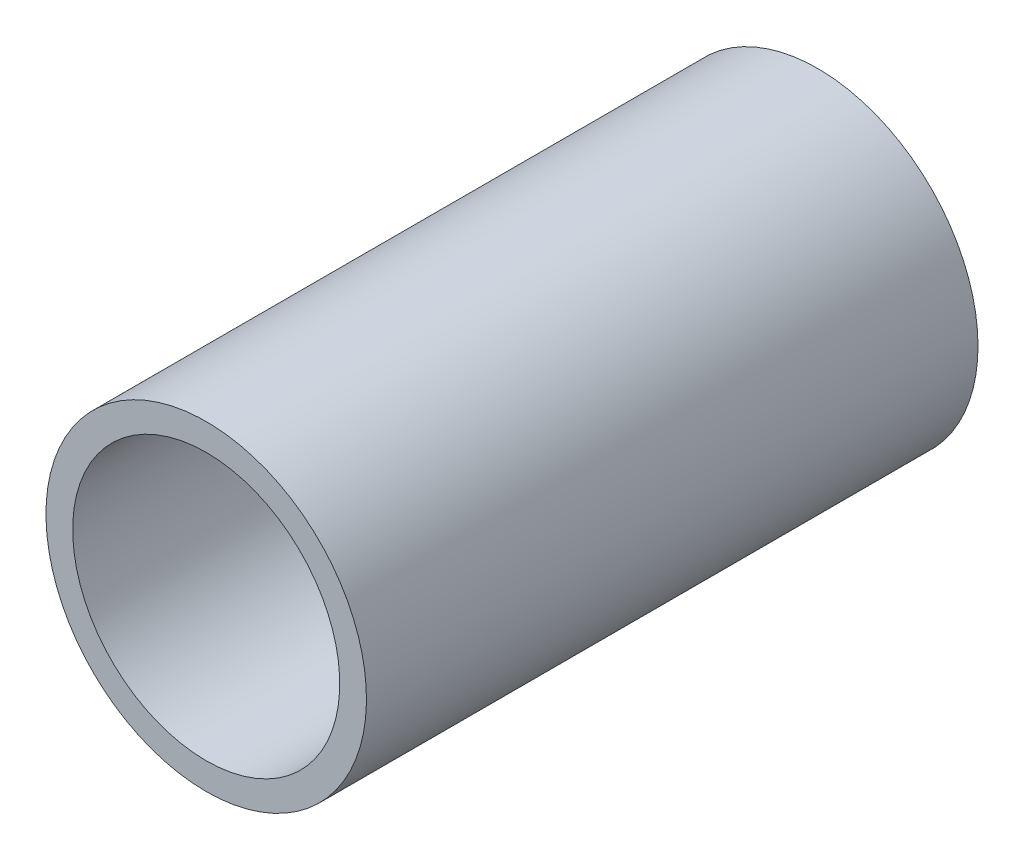
ISO-10303-21;
HEADER;
FILE_DESCRIPTION(('STEP AP214'),'2;1');
FILE_NAME('part.step','',(''),(''),'','','');
FILE_SCHEMA(('AUTOMOTIVE_DESIGN { 1 0 10303 214 1 1 1 1 }'));
ENDSEC;
DATA;
#1=APPLICATION_CONTEXT('core data for automotive mechanical design processes');
#2=APPLICATION_PROTOCOL_DEFINITION('international standard','automotive_design',2000,#1);
#3=PRODUCT_CONTEXT('',#1,'mechanical');
#4=PRODUCT('Part','Part','',(#3));
#5=PRODUCT_RELATED_PRODUCT_CATEGORY('part','',(#4));
#6=PRODUCT_DEFINITION_FORMATION('','',#4);
#7=PRODUCT_DEFINITION_CONTEXT('part definition',#1,'design');
#8=PRODUCT_DEFINITION('design','',#6,#7);
#9=PRODUCT_DEFINITION_SHAPE('','',#8);
#10=(LENGTH_UNIT() NAMED_UNIT(*) SI_UNIT(.MILLI.,.METRE.));
#11=(NAMED_UNIT(*) PLANE_ANGLE_UNIT() SI_UNIT($,.RADIAN.));
#12=(NAMED_UNIT(*) SI_UNIT($,.STERADIAN.) SOLID_ANGLE_UNIT());
#13=UNCERTAINTY_MEASURE_WITH_UNIT(LENGTH_MEASURE(1.E-05),#10,'distance_accuracy_value','');
#14=(GEOMETRIC_REPRESENTATION_CONTEXT(3) GLOBAL_UNCERTAINTY_ASSIGNED_CONTEXT((#13)) GLOBAL_UNIT_ASSIGNED_CONTEXT((#10,
#11,#12)) REPRESENTATION_CONTEXT('',''));
#15=CARTESIAN_POINT('',(0.,0.,0.));
#16=DIRECTION('',(0.,0.,1.));
#17=DIRECTION('',(1.,0.,0.));
#18=AXIS2_PLACEMENT_3D('',#15,#16,#17);
#19=CARTESIAN_POINT('',(0.,0.,39.8675929400946));
#20=DIRECTION('',(0.,0.,-1.));
#21=DIRECTION('',(-1.,0.,0.));
#22=AXIS2_PLACEMENT_3D('',#19,#20,#21);
#23=CYLINDRICAL_SURFACE('',#22,6.);
#24=CARTESIAN_POINT('',(0.,0.,0.));
#25=DIRECTION('',(0.,0.,1.));
#26=DIRECTION('',(1.,0.,0.));
#27=AXIS2_PLACEMENT_3D('',#24,#25,#26);
#28=CIRCLE('',#27,6.);
#29=CARTESIAN_POINT('',(6.,0.,0.));
#30=VERTEX_POINT('',#29);
#31=EDGE_CURVE('E42',#30,#30,#28,.T.);
#32=ORIENTED_EDGE('',*,*,#31,.T.);
#33=EDGE_LOOP('',(#32));
#34=FACE_BOUND('',#33,.T.);
#35=CARTESIAN_POINT('',(0.,0.,22.8970301916175));
#36=DIRECTION('',(0.,0.,1.));
#37=DIRECTION('',(0.,-1.,0.));
#38=AXIS2_PLACEMENT_3D('',#35,#36,#37);
#39=CIRCLE('',#38,6.);
#40=CARTESIAN_POINT('',(0.,-6.,22.8970301916175));
#41=VERTEX_POINT('',#40);
#42=EDGE_CURVE('E10',#41,#41,#39,.T.);
#43=ORIENTED_EDGE('',*,*,#42,.F.);
#44=EDGE_LOOP('',(#43));
#45=FACE_BOUND('',#44,.T.);
#46=ADVANCED_FACE('F35',(#34,#45),#23,.T.);
#47=CARTESIAN_POINT('',(0.,0.,0.));
#48=DIRECTION('',(0.,0.,1.));
#49=DIRECTION('',(1.,0.,0.));
#50=AXIS2_PLACEMENT_3D('',#47,#48,#49);
#51=PLANE('',#50);
#52=ORIENTED_EDGE('',*,*,#31,.F.);
#53=EDGE_LOOP('',(#52));
#54=FACE_BOUND('',#53,.T.);
#55=CARTESIAN_POINT('',(0.,0.,0.));
#56=DIRECTION('',(0.,0.,1.));
#57=DIRECTION('',(1.,0.,0.));
#58=AXIS2_PLACEMENT_3D('',#55,#56,#57);
#59=CIRCLE('',#58,5.);
#60=CARTESIAN_POINT('',(5.,0.,0.));
#61=VERTEX_POINT('',#60);
#62=EDGE_CURVE('E47',#61,#61,#59,.T.);
#63=ORIENTED_EDGE('',*,*,#62,.T.);
#64=EDGE_LOOP('',(#63));
#65=FACE_BOUND('',#64,.T.);
#66=ADVANCED_FACE('F63',(#54,#65),#51,.F.);
#67=CARTESIAN_POINT('',(0.,0.,39.8675929400946));
#68=DIRECTION('',(0.,0.,-1.));
#69=DIRECTION('',(-1.,0.,0.));
#70=AXIS2_PLACEMENT_3D('',#67,#68,#69);
#71=CYLINDRICAL_SURFACE('',#70,5.);
#72=ORIENTED_EDGE('',*,*,#62,.F.);
#73=EDGE_LOOP('',(#72));
#74=FACE_BOUND('',#73,.T.);
#75=CARTESIAN_POINT('',(0.,0.,22.8970301916175));
#76=DIRECTION('',(0.,0.,1.));
#77=DIRECTION('',(0.,-1.,0.));
#78=AXIS2_PLACEMENT_3D('',#75,#76,#77);
#79=CIRCLE('',#78,5.);
#80=CARTESIAN_POINT('',(0.,-5.,22.8970301916175));
#81=VERTEX_POINT('',#80);
#82=EDGE_CURVE('E38',#81,#81,#79,.T.);
#83=ORIENTED_EDGE('',*,*,#82,.T.);
#84=EDGE_LOOP('',(#83));
#85=FACE_BOUND('',#84,.T.);
#86=ADVANCED_FACE('F55',(#74,#85),#71,.F.);
#87=CARTESIAN_POINT('',(-0.0981643605176554,5.24908218247002,22.8970301916175));
#88=DIRECTION('',(0.,0.,1.));
#89=DIRECTION('',(0.0186979734319343,-0.999825177613336,0.));
#90=AXIS2_PLACEMENT_3D('',#87,#88,#89);
#91=PLANE('',#90);
#92=ORIENTED_EDGE('',*,*,#82,.F.);
#93=EDGE_LOOP('',(#92));
#94=FACE_BOUND('',#93,.T.);
#95=ORIENTED_EDGE('',*,*,#42,.T.);
#96=EDGE_LOOP('',(#95));
#97=FACE_BOUND('',#96,.T.);
#98=ADVANCED_FACE('F57',(#94,#97),#91,.T.);
#99=CLOSED_SHELL('',(#46,#66,#86,#98));
#100=MANIFOLD_SOLID_BREP('B2',#99);
#101=ADVANCED_BREP_SHAPE_REPRESENTATION('',(#18,#100),#14);
#102=SHAPE_DEFINITION_REPRESENTATION(#9,#101);
ENDSEC;
END-ISO-10303-21;
